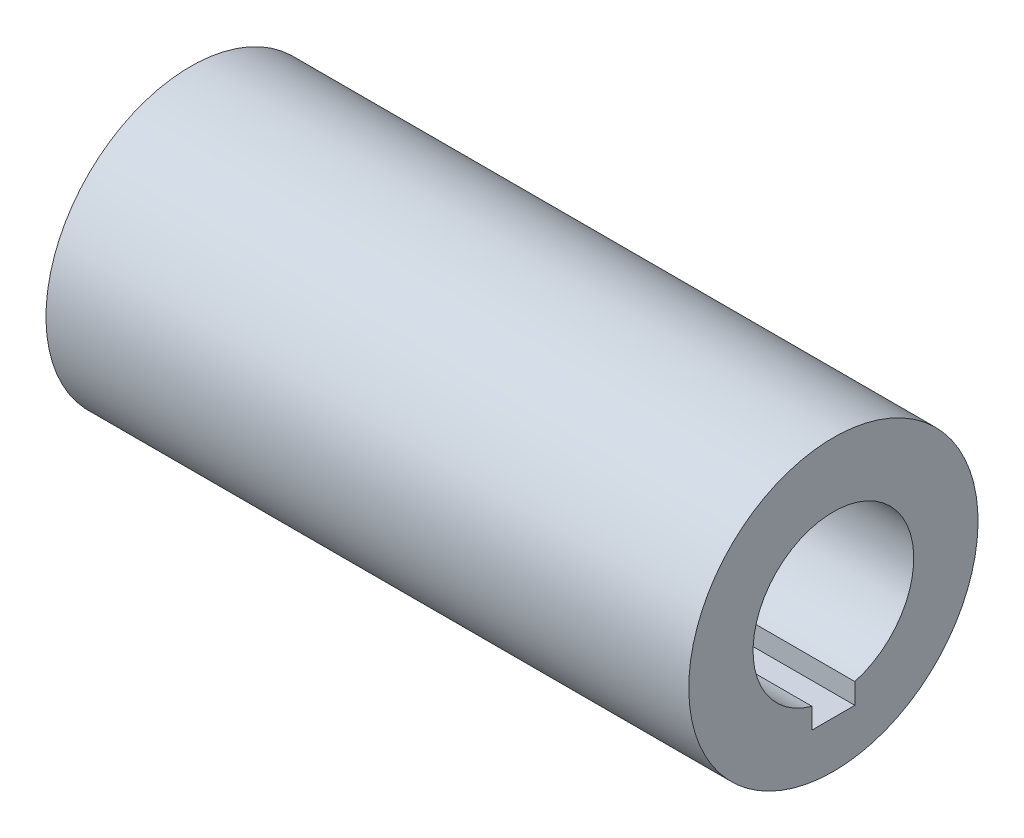
ISO-10303-21;
HEADER;
FILE_DESCRIPTION(('STEP AP214'),'2;1');
FILE_NAME('part.step','',(''),(''),'','','');
FILE_SCHEMA(('AUTOMOTIVE_DESIGN { 1 0 10303 214 1 1 1 1 }'));
ENDSEC;
DATA;
#1=APPLICATION_CONTEXT('core data for automotive mechanical design processes');
#2=APPLICATION_PROTOCOL_DEFINITION('international standard','automotive_design',2000,#1);
#3=PRODUCT_CONTEXT('',#1,'mechanical');
#4=PRODUCT('Part','Part','',(#3));
#5=PRODUCT_RELATED_PRODUCT_CATEGORY('part','',(#4));
#6=PRODUCT_DEFINITION_FORMATION('','',#4);
#7=PRODUCT_DEFINITION_CONTEXT('part definition',#1,'design');
#8=PRODUCT_DEFINITION('design','',#6,#7);
#9=PRODUCT_DEFINITION_SHAPE('','',#8);
#10=(LENGTH_UNIT() NAMED_UNIT(*) SI_UNIT(.MILLI.,.METRE.));
#11=(NAMED_UNIT(*) PLANE_ANGLE_UNIT() SI_UNIT($,.RADIAN.));
#12=(NAMED_UNIT(*) SI_UNIT($,.STERADIAN.) SOLID_ANGLE_UNIT());
#13=UNCERTAINTY_MEASURE_WITH_UNIT(LENGTH_MEASURE(1.E-05),#10,'distance_accuracy_value','');
#14=(GEOMETRIC_REPRESENTATION_CONTEXT(3) GLOBAL_UNCERTAINTY_ASSIGNED_CONTEXT((#13)) GLOBAL_UNIT_ASSIGNED_CONTEXT((#10,
#11,#12)) REPRESENTATION_CONTEXT('',''));
#15=CARTESIAN_POINT('',(0.,0.,0.));
#16=DIRECTION('',(0.,0.,1.));
#17=DIRECTION('',(1.,0.,0.));
#18=AXIS2_PLACEMENT_3D('',#15,#16,#17);
#19=CARTESIAN_POINT('',(-60.,15.,0.));
#20=DIRECTION('',(1.,0.,0.));
#21=DIRECTION('',(0.,1.,0.));
#22=AXIS2_PLACEMENT_3D('',#19,#20,#21);
#23=PLANE('',#22);
#24=DIRECTION('',(0.,0.,1.));
#25=VECTOR('',#24,1.);
#26=CARTESIAN_POINT('',(-60.,-18.3,-3.99999999999996));
#27=LINE('',#26,#25);
#28=CARTESIAN_POINT('',(-60.,-18.3,-3.99999999999996));
#29=VERTEX_POINT('',#28);
#30=CARTESIAN_POINT('',(-60.,-18.3,4.00000000000004));
#31=VERTEX_POINT('',#30);
#32=EDGE_CURVE('E76',#29,#31,#27,.T.);
#33=ORIENTED_EDGE('',*,*,#32,.F.);
#34=DIRECTION('',(0.,1.,0.));
#35=VECTOR('',#34,1.);
#36=CARTESIAN_POINT('',(-60.,-18.3,-3.99999999999996));
#37=LINE('',#36,#35);
#38=CARTESIAN_POINT('',(-60.,-14.4568322948009,-3.99999999999996));
#39=VERTEX_POINT('',#38);
#40=EDGE_CURVE('E97',#29,#39,#37,.T.);
#41=ORIENTED_EDGE('',*,*,#40,.T.);
#42=CARTESIAN_POINT('',(-60.,0.,0.));
#43=DIRECTION('',(-1.,0.,0.));
#44=DIRECTION('',(0.,-1.,0.));
#45=AXIS2_PLACEMENT_3D('',#42,#43,#44);
#46=CIRCLE('',#45,15.);
#47=CARTESIAN_POINT('',(-60.,-14.4568322948009,4.00000000000004));
#48=VERTEX_POINT('',#47);
#49=EDGE_CURVE('E88',#48,#39,#46,.T.);
#50=ORIENTED_EDGE('',*,*,#49,.F.);
#51=DIRECTION('',(0.,1.,0.));
#52=VECTOR('',#51,1.);
#53=CARTESIAN_POINT('',(-60.,-18.3,4.00000000000004));
#54=LINE('',#53,#52);
#55=EDGE_CURVE('E46',#31,#48,#54,.T.);
#56=ORIENTED_EDGE('',*,*,#55,.F.);
#57=EDGE_LOOP('',(#33,#41,#50,#56));
#58=FACE_BOUND('',#57,.T.);
#59=CARTESIAN_POINT('',(-60.,0.,0.));
#60=DIRECTION('',(-1.,0.,0.));
#61=DIRECTION('',(0.,-1.,0.));
#62=AXIS2_PLACEMENT_3D('',#59,#60,#61);
#63=CIRCLE('',#62,27.);
#64=CARTESIAN_POINT('',(-60.,-27.,0.));
#65=VERTEX_POINT('',#64);
#66=EDGE_CURVE('E103',#65,#65,#63,.T.);
#67=ORIENTED_EDGE('',*,*,#66,.T.);
#68=EDGE_LOOP('',(#67));
#69=FACE_BOUND('',#68,.T.);
#70=ADVANCED_FACE('F32',(#58,#69),#23,.F.);
#71=CARTESIAN_POINT('',(-60.,0.,0.));
#72=DIRECTION('',(-1.,0.,0.));
#73=DIRECTION('',(0.,-1.,0.));
#74=AXIS2_PLACEMENT_3D('',#71,#72,#73);
#75=CYLINDRICAL_SURFACE('',#74,27.);
#76=ORIENTED_EDGE('',*,*,#66,.F.);
#77=EDGE_LOOP('',(#76));
#78=FACE_BOUND('',#77,.T.);
#79=CARTESIAN_POINT('',(60.,0.,0.));
#80=DIRECTION('',(-1.,0.,0.));
#81=DIRECTION('',(0.,-1.,0.));
#82=AXIS2_PLACEMENT_3D('',#79,#80,#81);
#83=CIRCLE('',#82,27.);
#84=CARTESIAN_POINT('',(60.,-27.,0.));
#85=VERTEX_POINT('',#84);
#86=EDGE_CURVE('E100',#85,#85,#83,.T.);
#87=ORIENTED_EDGE('',*,*,#86,.T.);
#88=EDGE_LOOP('',(#87));
#89=FACE_BOUND('',#88,.T.);
#90=ADVANCED_FACE('F125',(#78,#89),#75,.T.);
#91=CARTESIAN_POINT('',(60.,15.,0.));
#92=DIRECTION('',(-1.,0.,0.));
#93=DIRECTION('',(0.,-1.,0.));
#94=AXIS2_PLACEMENT_3D('',#91,#92,#93);
#95=PLANE('',#94);
#96=CARTESIAN_POINT('',(60.,0.,0.));
#97=DIRECTION('',(-1.,0.,0.));
#98=DIRECTION('',(0.,-1.,0.));
#99=AXIS2_PLACEMENT_3D('',#96,#97,#98);
#100=CIRCLE('',#99,15.);
#101=CARTESIAN_POINT('',(60.,-14.4568322948009,4.00000000000004));
#102=VERTEX_POINT('',#101);
#103=CARTESIAN_POINT('',(60.,-14.4568322948009,-4.00000000000004));
#104=VERTEX_POINT('',#103);
#105=EDGE_CURVE('E96',#102,#104,#100,.T.);
#106=ORIENTED_EDGE('',*,*,#105,.T.);
#107=DIRECTION('',(0.,1.,0.));
#108=VECTOR('',#107,1.);
#109=CARTESIAN_POINT('',(60.,-18.3,-4.00000000000004));
#110=LINE('',#109,#108);
#111=CARTESIAN_POINT('',(60.,-18.3,-4.00000000000004));
#112=VERTEX_POINT('',#111);
#113=EDGE_CURVE('E90',#112,#104,#110,.T.);
#114=ORIENTED_EDGE('',*,*,#113,.F.);
#115=DIRECTION('',(0.,0.,-1.));
#116=VECTOR('',#115,1.);
#117=CARTESIAN_POINT('',(60.,-18.3,-4.00000000000004));
#118=LINE('',#117,#116);
#119=CARTESIAN_POINT('',(60.,-18.3,4.00000000000004));
#120=VERTEX_POINT('',#119);
#121=EDGE_CURVE('E75',#120,#112,#118,.T.);
#122=ORIENTED_EDGE('',*,*,#121,.F.);
#123=DIRECTION('',(0.,1.,0.));
#124=VECTOR('',#123,1.);
#125=CARTESIAN_POINT('',(60.,-18.3,4.00000000000004));
#126=LINE('',#125,#124);
#127=EDGE_CURVE('E72',#120,#102,#126,.T.);
#128=ORIENTED_EDGE('',*,*,#127,.T.);
#129=EDGE_LOOP('',(#106,#114,#122,#128));
#130=FACE_BOUND('',#129,.T.);
#131=ORIENTED_EDGE('',*,*,#86,.F.);
#132=EDGE_LOOP('',(#131));
#133=FACE_BOUND('',#132,.T.);
#134=ADVANCED_FACE('F109',(#130,#133),#95,.F.);
#135=CARTESIAN_POINT('',(-60.,0.,0.));
#136=DIRECTION('',(-1.,0.,0.));
#137=DIRECTION('',(0.,-1.,0.));
#138=AXIS2_PLACEMENT_3D('',#135,#136,#137);
#139=CYLINDRICAL_SURFACE('',#138,15.);
#140=ORIENTED_EDGE('',*,*,#49,.T.);
#141=DIRECTION('',(-1.,0.,0.));
#142=VECTOR('',#141,1.);
#143=CARTESIAN_POINT('',(-60.,-14.456832294801,-3.99999999999996));
#144=LINE('',#143,#142);
#145=EDGE_CURVE('E11',#39,#104,#144,.F.);
#146=ORIENTED_EDGE('',*,*,#145,.T.);
#147=ORIENTED_EDGE('',*,*,#105,.F.);
#148=DIRECTION('',(-1.,0.,0.));
#149=VECTOR('',#148,1.);
#150=CARTESIAN_POINT('',(-60.,-14.4568322948009,4.00000000000004));
#151=LINE('',#150,#149);
#152=EDGE_CURVE('E39',#102,#48,#151,.T.);
#153=ORIENTED_EDGE('',*,*,#152,.T.);
#154=EDGE_LOOP('',(#140,#146,#147,#153));
#155=FACE_BOUND('',#154,.T.);
#156=ADVANCED_FACE('F107',(#155),#139,.F.);
#157=CARTESIAN_POINT('',(-60.,-18.3,-3.99999999999996));
#158=DIRECTION('',(0.,0.,-1.));
#159=DIRECTION('',(-1.,0.,0.));
#160=AXIS2_PLACEMENT_3D('',#157,#158,#159);
#161=PLANE('',#160);
#162=ORIENTED_EDGE('',*,*,#40,.F.);
#163=DIRECTION('',(-1.,0.,0.));
#164=VECTOR('',#163,1.);
#165=CARTESIAN_POINT('',(-60.,-18.3,-3.99999999999996));
#166=LINE('',#165,#164);
#167=EDGE_CURVE('E82',#112,#29,#166,.T.);
#168=ORIENTED_EDGE('',*,*,#167,.F.);
#169=ORIENTED_EDGE('',*,*,#113,.T.);
#170=ORIENTED_EDGE('',*,*,#145,.F.);
#171=EDGE_LOOP('',(#162,#168,#169,#170));
#172=FACE_BOUND('',#171,.T.);
#173=ADVANCED_FACE('F114',(#172),#161,.F.);
#174=CARTESIAN_POINT('',(-60.,-18.3,4.00000000000004));
#175=DIRECTION('',(0.,0.,1.));
#176=DIRECTION('',(1.,0.,0.));
#177=AXIS2_PLACEMENT_3D('',#174,#175,#176);
#178=PLANE('',#177);
#179=ORIENTED_EDGE('',*,*,#127,.F.);
#180=DIRECTION('',(1.,0.,0.));
#181=VECTOR('',#180,1.);
#182=CARTESIAN_POINT('',(-60.,-18.3,4.00000000000004));
#183=LINE('',#182,#181);
#184=EDGE_CURVE('E68',#31,#120,#183,.T.);
#185=ORIENTED_EDGE('',*,*,#184,.F.);
#186=ORIENTED_EDGE('',*,*,#55,.T.);
#187=ORIENTED_EDGE('',*,*,#152,.F.);
#188=EDGE_LOOP('',(#179,#185,#186,#187));
#189=FACE_BOUND('',#188,.T.);
#190=ADVANCED_FACE('F70',(#189),#178,.F.);
#191=CARTESIAN_POINT('',(0.,-18.3,0.));
#192=DIRECTION('',(0.,1.,0.));
#193=DIRECTION('',(0.,0.,1.));
#194=AXIS2_PLACEMENT_3D('',#191,#192,#193);
#195=PLANE('',#194);
#196=ORIENTED_EDGE('',*,*,#32,.T.);
#197=ORIENTED_EDGE('',*,*,#184,.T.);
#198=ORIENTED_EDGE('',*,*,#121,.T.);
#199=ORIENTED_EDGE('',*,*,#167,.T.);
#200=EDGE_LOOP('',(#196,#197,#198,#199));
#201=FACE_BOUND('',#200,.T.);
#202=ADVANCED_FACE('F80',(#201),#195,.T.);
#203=CLOSED_SHELL('',(#70,#90,#134,#156,#173,#190,#202));
#204=MANIFOLD_SOLID_BREP('B2',#203);
#205=ADVANCED_BREP_SHAPE_REPRESENTATION('',(#18,#204),#14);
#206=SHAPE_DEFINITION_REPRESENTATION(#9,#205);
ENDSEC;
END-ISO-10303-21;
